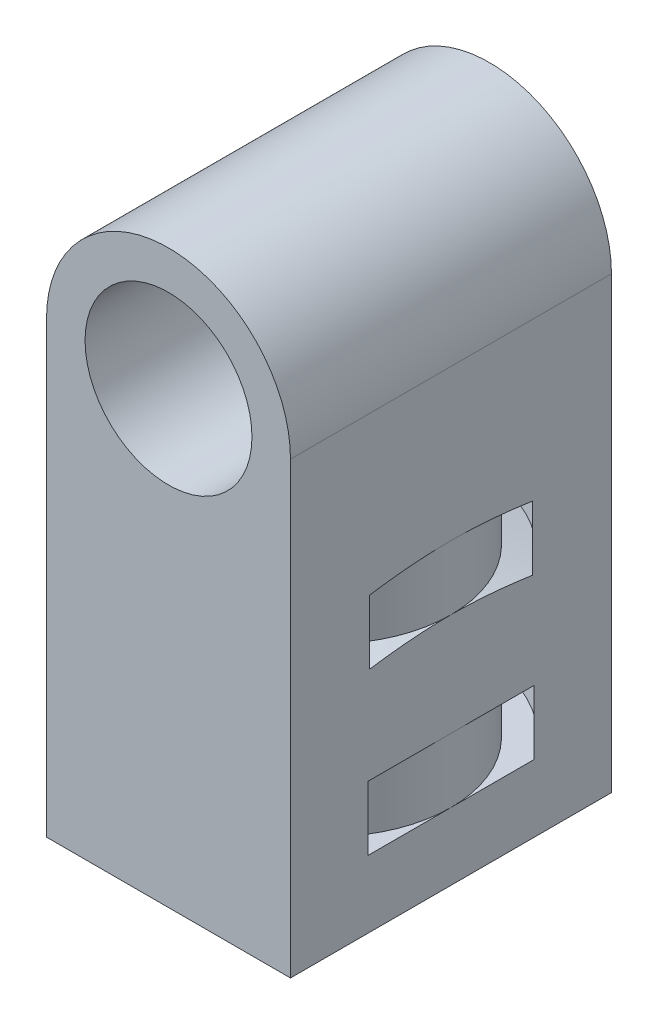
ISO-10303-21;
HEADER;
FILE_DESCRIPTION(('STEP AP214'),'2;1');
FILE_NAME('part.step','',(''),(''),'','','');
FILE_SCHEMA(('AUTOMOTIVE_DESIGN { 1 0 10303 214 1 1 1 1 }'));
ENDSEC;
DATA;
#1=APPLICATION_CONTEXT('core data for automotive mechanical design processes');
#2=APPLICATION_PROTOCOL_DEFINITION('international standard','automotive_design',2000,#1);
#3=PRODUCT_CONTEXT('',#1,'mechanical');
#4=PRODUCT('Part','Part','',(#3));
#5=PRODUCT_RELATED_PRODUCT_CATEGORY('part','',(#4));
#6=PRODUCT_DEFINITION_FORMATION('','',#4);
#7=PRODUCT_DEFINITION_CONTEXT('part definition',#1,'design');
#8=PRODUCT_DEFINITION('design','',#6,#7);
#9=PRODUCT_DEFINITION_SHAPE('','',#8);
#10=(LENGTH_UNIT() NAMED_UNIT(*) SI_UNIT(.MILLI.,.METRE.));
#11=(NAMED_UNIT(*) PLANE_ANGLE_UNIT() SI_UNIT($,.RADIAN.));
#12=(NAMED_UNIT(*) SI_UNIT($,.STERADIAN.) SOLID_ANGLE_UNIT());
#13=UNCERTAINTY_MEASURE_WITH_UNIT(LENGTH_MEASURE(1.E-05),#10,'distance_accuracy_value','');
#14=(GEOMETRIC_REPRESENTATION_CONTEXT(3) GLOBAL_UNCERTAINTY_ASSIGNED_CONTEXT((#13)) GLOBAL_UNIT_ASSIGNED_CONTEXT((#10,
#11,#12)) REPRESENTATION_CONTEXT('',''));
#15=CARTESIAN_POINT('',(0.,0.,0.));
#16=DIRECTION('',(0.,0.,1.));
#17=DIRECTION('',(1.,0.,0.));
#18=AXIS2_PLACEMENT_3D('',#15,#16,#17);
#19=CARTESIAN_POINT('',(9.5,-10.,-12.5));
#20=DIRECTION('',(1.,0.,0.));
#21=DIRECTION('',(0.,1.,0.));
#22=AXIS2_PLACEMENT_3D('',#19,#20,#21);
#23=PLANE('',#22);
#24=DIRECTION('',(0.,0.,-1.));
#25=VECTOR('',#24,1.);
#26=CARTESIAN_POINT('',(9.5,-29.75,-12.5));
#27=LINE('',#26,#25);
#28=CARTESIAN_POINT('',(9.5,-29.75,6.48074069840786));
#29=VERTEX_POINT('',#28);
#30=CARTESIAN_POINT('',(9.5,-29.75,0.));
#31=VERTEX_POINT('',#30);
#32=EDGE_CURVE('E312',#29,#31,#27,.T.);
#33=ORIENTED_EDGE('',*,*,#32,.F.);
#34=DIRECTION('',(0.,1.,0.));
#35=VECTOR('',#34,1.);
#36=CARTESIAN_POINT('',(9.5,-6.5,6.48074069840786));
#37=LINE('',#36,#35);
#38=CARTESIAN_POINT('',(9.5,-24.75,6.48074069840786));
#39=VERTEX_POINT('',#38);
#40=EDGE_CURVE('E336',#39,#29,#37,.F.);
#41=ORIENTED_EDGE('',*,*,#40,.F.);
#42=DIRECTION('',(0.,0.,-1.));
#43=VECTOR('',#42,1.);
#44=CARTESIAN_POINT('',(9.5,-24.75,-12.5));
#45=LINE('',#44,#43);
#46=CARTESIAN_POINT('',(9.5,-24.75,0.));
#47=VERTEX_POINT('',#46);
#48=EDGE_CURVE('E339',#39,#47,#45,.T.);
#49=ORIENTED_EDGE('',*,*,#48,.T.);
#50=CARTESIAN_POINT('',(9.5,-24.75,-6.48074069840786));
#51=VERTEX_POINT('',#50);
#52=EDGE_CURVE('E176',#47,#51,#45,.T.);
#53=ORIENTED_EDGE('',*,*,#52,.T.);
#54=DIRECTION('',(0.,1.,0.));
#55=VECTOR('',#54,1.);
#56=CARTESIAN_POINT('',(9.5,-6.5,-6.48074069840786));
#57=LINE('',#56,#55);
#58=CARTESIAN_POINT('',(9.5,-29.75,-6.48074069840786));
#59=VERTEX_POINT('',#58);
#60=EDGE_CURVE('E334',#59,#51,#57,.T.);
#61=ORIENTED_EDGE('',*,*,#60,.F.);
#62=EDGE_CURVE('E331',#31,#59,#27,.T.);
#63=ORIENTED_EDGE('',*,*,#62,.F.);
#64=EDGE_LOOP('',(#33,#41,#49,#53,#61,#63));
#65=FACE_BOUND('',#64,.T.);
#66=DIRECTION('',(0.,1.,0.));
#67=VECTOR('',#66,1.);
#68=CARTESIAN_POINT('',(9.5,-10.,12.5));
#69=LINE('',#68,#67);
#70=CARTESIAN_POINT('',(9.5,-35.,12.5));
#71=VERTEX_POINT('',#70);
#72=CARTESIAN_POINT('',(9.5,0.,12.5));
#73=VERTEX_POINT('',#72);
#74=EDGE_CURVE('E316',#71,#73,#69,.T.);
#75=ORIENTED_EDGE('',*,*,#74,.F.);
#76=DIRECTION('',(0.,0.,1.));
#77=VECTOR('',#76,1.);
#78=CARTESIAN_POINT('',(9.5,-35.,-12.5));
#79=LINE('',#78,#77);
#80=CARTESIAN_POINT('',(9.5,-35.,-12.5));
#81=VERTEX_POINT('',#80);
#82=EDGE_CURVE('E423',#81,#71,#79,.T.);
#83=ORIENTED_EDGE('',*,*,#82,.F.);
#84=DIRECTION('',(0.,1.,0.));
#85=VECTOR('',#84,1.);
#86=CARTESIAN_POINT('',(9.5,-10.,-12.5));
#87=LINE('',#86,#85);
#88=CARTESIAN_POINT('',(9.5,0.,-12.5));
#89=VERTEX_POINT('',#88);
#90=EDGE_CURVE('E439',#81,#89,#87,.T.);
#91=ORIENTED_EDGE('',*,*,#90,.T.);
#92=DIRECTION('',(0.,0.,1.));
#93=VECTOR('',#92,1.);
#94=CARTESIAN_POINT('',(9.5,0.,-12.5));
#95=LINE('',#94,#93);
#96=EDGE_CURVE('E451',#89,#73,#95,.T.);
#97=ORIENTED_EDGE('',*,*,#96,.T.);
#98=EDGE_LOOP('',(#75,#83,#91,#97));
#99=FACE_BOUND('',#98,.T.);
#100=CARTESIAN_POINT('',(9.5,-18.5940001794606,34.3096150478611));
#101=CARTESIAN_POINT('',(9.5,-18.4104595878438,33.583287858128));
#102=CARTESIAN_POINT('',(9.5,-18.2272942427413,32.8568655741935));
#103=CARTESIAN_POINT('',(9.5,-17.8619040372227,31.4037835481128));
#104=CARTESIAN_POINT('',(9.5,-17.6796791780349,30.6771238056579));
#105=CARTESIAN_POINT('',(9.5,-17.316309413949,29.2233174338884));
#106=CARTESIAN_POINT('',(9.5,-17.1351648266208,28.4961707251553));
#107=CARTESIAN_POINT('',(9.5,-16.7742688751346,27.0415315671237));
#108=CARTESIAN_POINT('',(9.5,-16.5945175107908,26.3140391178712));
#109=CARTESIAN_POINT('',(9.5,-16.2325036702304,24.8413595475527));
#110=CARTESIAN_POINT('',(9.5,-16.0502828229413,24.0961621847589));
#111=CARTESIAN_POINT('',(9.5,-15.6881513560162,22.6052065111694));
#112=CARTESIAN_POINT('',(9.5,-15.5082407340685,21.8594482009359));
#113=CARTESIAN_POINT('',(9.5,-15.1514551431804,20.3674081549243));
#114=CARTESIAN_POINT('',(9.5,-14.9745794026589,19.6211266039413));
#115=CARTESIAN_POINT('',(9.5,-14.6247702626984,18.1276365749566));
#116=CARTESIAN_POINT('',(9.5,-14.4518368707429,17.3804280951981));
#117=CARTESIAN_POINT('',(9.5,-14.1187198970002,15.9174306703127));
#118=CARTESIAN_POINT('',(9.5,-13.9583092568577,15.2016936038036));
#119=CARTESIAN_POINT('',(9.5,-13.6441128718866,13.7687633704708));
#120=CARTESIAN_POINT('',(9.5,-13.4903271161288,13.0515702060512));
#121=CARTESIAN_POINT('',(9.5,-13.1917895153087,11.6145241203518));
#122=CARTESIAN_POINT('',(9.5,-13.0470470186099,10.8946692356507));
#123=CARTESIAN_POINT('',(9.5,-12.839755242133,9.81298195188404));
#124=CARTESIAN_POINT('',(9.5,-12.7722931956616,9.45209172028482));
#125=CARTESIAN_POINT('',(9.5,-12.6413092515822,8.72959877826552));
#126=CARTESIAN_POINT('',(9.5,-12.5777873110619,8.36799607564936));
#127=CARTESIAN_POINT('',(9.5,-12.4562624738004,7.64881234547324));
#128=CARTESIAN_POINT('',(9.5,-12.3981973188229,7.29124192731229));
#129=CARTESIAN_POINT('',(9.5,-12.2875208224032,6.57526148055471));
#130=CARTESIAN_POINT('',(9.5,-12.2349095407431,6.2168514427987));
#131=CARTESIAN_POINT('',(9.5,-12.0867396466977,5.14026211042967));
#132=CARTESIAN_POINT('',(9.5,-12.0008366490465,4.42067580269187));
#133=CARTESIAN_POINT('',(9.5,-11.8979840507362,3.33969834915197));
#134=CARTESIAN_POINT('',(9.5,-11.8680533098223,2.97952705245293));
#135=CARTESIAN_POINT('',(9.5,-11.8178069673897,2.25850381276945));
#136=CARTESIAN_POINT('',(9.5,-11.7974912985723,1.89765187456677));
#137=CARTESIAN_POINT('',(9.5,-11.7672603900713,1.17556904098546));
#138=CARTESIAN_POINT('',(9.5,-11.7573434008062,0.814338219595086));
#139=CARTESIAN_POINT('',(9.5,-11.7483184953059,0.0917406115624856));
#140=CARTESIAN_POINT('',(9.5,-11.7492105291058,-0.269626174443523));
#141=CARTESIAN_POINT('',(9.5,-11.7615452144799,-0.979590021655254));
#142=CARTESIAN_POINT('',(9.5,-11.7726194406145,-1.32819362528374));
#143=CARTESIAN_POINT('',(9.5,-11.8043716631822,-2.02495921088784));
#144=CARTESIAN_POINT('',(9.5,-11.8250496920841,-2.3731211913664));
#145=CARTESIAN_POINT('',(9.5,-11.8752800186238,-3.06885676445908));
#146=CARTESIAN_POINT('',(9.5,-11.9048338111138,-3.41643024803479));
#147=CARTESIAN_POINT('',(9.5,-11.9718973690187,-4.11081466006508));
#148=CARTESIAN_POINT('',(9.5,-12.0094074842543,-4.45762555431275));
#149=CARTESIAN_POINT('',(9.5,-12.1325595533156,-5.49846097059398));
#150=CARTESIAN_POINT('',(9.5,-12.2286955308348,-6.19124608496361));
#151=CARTESIAN_POINT('',(9.5,-12.4413393013675,-7.57355613875835));
#152=CARTESIAN_POINT('',(9.5,-12.557846278919,-8.26308120755049));
#153=CARTESIAN_POINT('',(9.5,-12.8070220094514,-9.64873950406036));
#154=CARTESIAN_POINT('',(9.5,-12.9398867973797,-10.344837116822));
#155=CARTESIAN_POINT('',(9.5,-13.2161792537895,-11.7349056381745));
#156=CARTESIAN_POINT('',(9.5,-13.3596068317596,-12.4288765649356));
#157=CARTESIAN_POINT('',(9.5,-13.6538996084103,-13.814436250205));
#158=CARTESIAN_POINT('',(9.5,-13.8047564832014,-14.5060267859574));
#159=CARTESIAN_POINT('',(9.5,-14.1120291641412,-15.8879648182586));
#160=CARTESIAN_POINT('',(9.5,-14.2684449535411,-16.5783123185461));
#161=CARTESIAN_POINT('',(9.5,-14.5923627636727,-17.9882129158208));
#162=CARTESIAN_POINT('',(9.5,-14.760050488671,-18.7077232451551));
#163=CARTESIAN_POINT('',(9.5,-15.0988377625137,-20.1459384828576));
#164=CARTESIAN_POINT('',(9.5,-15.2699373109351,-20.8646433913256));
#165=CARTESIAN_POINT('',(9.5,-15.6148158829257,-22.3016540726439));
#166=CARTESIAN_POINT('',(9.5,-15.7885957519021,-23.0199596423348));
#167=CARTESIAN_POINT('',(9.5,-16.1382105351397,-24.4560706148763));
#168=CARTESIAN_POINT('',(9.5,-16.3140454510682,-25.1738760173206));
#169=CARTESIAN_POINT('',(9.5,-16.6635670998738,-26.5937178124066));
#170=CARTESIAN_POINT('',(9.5,-16.8372192064394,-27.295762735252));
#171=CARTESIAN_POINT('',(9.5,-17.1857929643631,-28.6995373694732));
#172=CARTESIAN_POINT('',(9.5,-17.3607146160361,-29.4012670807707));
#173=CARTESIAN_POINT('',(9.5,-17.7115372088056,-30.8042243982583));
#174=CARTESIAN_POINT('',(9.5,-17.8874377913662,-31.5054520941489));
#175=CARTESIAN_POINT('',(9.5,-18.2401088008124,-32.9076878120199));
#176=CARTESIAN_POINT('',(9.5,-18.4168792266013,-33.608695834276));
#177=CARTESIAN_POINT('',(9.5,-18.5940001794606,-34.3096150478611));
#178=B_SPLINE_CURVE_WITH_KNOTS('',3,(#100,#101,#102,#103,#104,#105,#106,#107,#108,#109,#110,
#111,#112,#113,#114,#115,#116,#117,#118,#119,#120,#121,#122,#123,#124,#125,#126,#127,#128,#129,
#130,#131,#132,#133,#134,#135,#136,#137,#138,#139,#140,#141,#142,#143,#144,#145,#146,#147,#148,
#149,#150,#151,#152,#153,#154,#155,#156,#157,#158,#159,#160,#161,#162,#163,#164,#165,#166,#167,
#168,#169,#170,#171,#172,#173,#174,#175,#176,#177),.UNSPECIFIED.,.F.,.F.,(4,2,2,2,2,2,2,2,2,2,2,
2,2,2,2,2,2,2,2,2,2,2,2,2,2,2,2,2,2,2,2,2,2,2,2,2,2,2,4),(0.,2.24747554583677,4.4949540263018,
6.74306350480392,8.99117268337091,11.2926284845608,13.5940819827856,15.894941425808,
18.1958052360467,20.3962589262327,22.5967089861222,24.7993973315644,25.9008042763521,
27.0021992234385,28.0889193333589,29.1756513540005,31.3489699082154,32.4331041183486,
33.5172307401912,34.6011749280527,35.6851141053588,36.7313134417835,37.7775163152511,
38.8238954886518,39.8703206784272,41.9681082944804,44.065811954192,46.1916871419316,
48.3175441154162,50.4410711579981,52.564591803064,54.7809581966685,56.9973243155716,
59.2144044120004,61.4314863073811,63.6010929495919,65.7707001301629,67.9395590701614,
70.1084152760672),.UNSPECIFIED.);
#179=CARTESIAN_POINT('',(9.5,-12.2572833711301,6.36396078731212));
#180=VERTEX_POINT('',#179);
#181=CARTESIAN_POINT('',(9.5,-11.75,0.));
#182=VERTEX_POINT('',#181);
#183=EDGE_CURVE('E241',#180,#182,#178,.T.);
#184=ORIENTED_EDGE('',*,*,#183,.T.);
#185=CARTESIAN_POINT('',(9.5,-12.2572833711301,-6.36396078731212));
#186=VERTEX_POINT('',#185);
#187=EDGE_CURVE('E232',#182,#186,#178,.T.);
#188=ORIENTED_EDGE('',*,*,#187,.T.);
#189=DIRECTION('',(0.,1.,0.));
#190=VECTOR('',#189,1.);
#191=CARTESIAN_POINT('',(9.5,-6.5,-6.36396078731212));
#192=LINE('',#191,#190);
#193=CARTESIAN_POINT('',(9.5,-17.2572833711301,-6.36396078731212));
#194=VERTEX_POINT('',#193);
#195=EDGE_CURVE('E242',#186,#194,#192,.F.);
#196=ORIENTED_EDGE('',*,*,#195,.T.);
#197=CARTESIAN_POINT('',(9.5,-23.5940001794606,34.3096150478611));
#198=CARTESIAN_POINT('',(9.5,-23.4104595878438,33.583287858128));
#199=CARTESIAN_POINT('',(9.5,-23.2272942427413,32.8568655741935));
#200=CARTESIAN_POINT('',(9.5,-22.8619040372227,31.4037835481128));
#201=CARTESIAN_POINT('',(9.5,-22.6796791780349,30.6771238056579));
#202=CARTESIAN_POINT('',(9.5,-22.316309413949,29.2233174338884));
#203=CARTESIAN_POINT('',(9.5,-22.1351648266208,28.4961707251553));
#204=CARTESIAN_POINT('',(9.5,-21.7742688751346,27.0415315671237));
#205=CARTESIAN_POINT('',(9.5,-21.5945175107908,26.3140391178712));
#206=CARTESIAN_POINT('',(9.5,-21.2325036702303,24.8413595475526));
#207=CARTESIAN_POINT('',(9.5,-21.0502828229413,24.0961621847589));
#208=CARTESIAN_POINT('',(9.5,-20.6881513560162,22.6052065111694));
#209=CARTESIAN_POINT('',(9.5,-20.5082407340685,21.8594482009358));
#210=CARTESIAN_POINT('',(9.5,-20.1514551431804,20.3674081549243));
#211=CARTESIAN_POINT('',(9.5,-19.9745794026589,19.6211266039413));
#212=CARTESIAN_POINT('',(9.5,-19.6247702626984,18.1276365749566));
#213=CARTESIAN_POINT('',(9.5,-19.4518368707429,17.3804280951981));
#214=CARTESIAN_POINT('',(9.5,-19.1187198970002,15.9174306703127));
#215=CARTESIAN_POINT('',(9.5,-18.9583092568577,15.2016936038036));
#216=CARTESIAN_POINT('',(9.5,-18.6441128718866,13.7687633704708));
#217=CARTESIAN_POINT('',(9.5,-18.4903271161288,13.0515702060512));
#218=CARTESIAN_POINT('',(9.5,-18.1917895153087,11.6145241203518));
#219=CARTESIAN_POINT('',(9.5,-18.04704701861,10.8946692356508));
#220=CARTESIAN_POINT('',(9.5,-17.839755242133,9.81298195188405));
#221=CARTESIAN_POINT('',(9.5,-17.7722931956616,9.45209172028482));
#222=CARTESIAN_POINT('',(9.5,-17.6413092515822,8.72959877826553));
#223=CARTESIAN_POINT('',(9.5,-17.5777873110619,8.36799607564936));
#224=CARTESIAN_POINT('',(9.5,-17.4562624738004,7.64881234547325));
#225=CARTESIAN_POINT('',(9.5,-17.3981973188229,7.29124192731229));
#226=CARTESIAN_POINT('',(9.5,-17.2875208224032,6.57526148055472));
#227=CARTESIAN_POINT('',(9.5,-17.2349095407431,6.21685144279871));
#228=CARTESIAN_POINT('',(9.5,-17.0867396466977,5.14026211042967));
#229=CARTESIAN_POINT('',(9.5,-17.0008366490465,4.42067580269187));
#230=CARTESIAN_POINT('',(9.5,-16.8979840507362,3.33969834915197));
#231=CARTESIAN_POINT('',(9.5,-16.8680533098223,2.97952705245293));
#232=CARTESIAN_POINT('',(9.5,-16.8178069673897,2.25850381276945));
#233=CARTESIAN_POINT('',(9.5,-16.7974912985723,1.89765187456678));
#234=CARTESIAN_POINT('',(9.5,-16.7672603900713,1.17556904098547));
#235=CARTESIAN_POINT('',(9.5,-16.7573434008062,0.814338219595099));
#236=CARTESIAN_POINT('',(9.5,-16.7483184953059,0.0917406115624991));
#237=CARTESIAN_POINT('',(9.5,-16.7492105291058,-0.269626174443511));
#238=CARTESIAN_POINT('',(9.5,-16.7615452144799,-0.979590021655243));
#239=CARTESIAN_POINT('',(9.5,-16.7726194406145,-1.32819362528373));
#240=CARTESIAN_POINT('',(9.5,-16.8043716631822,-2.02495921088782));
#241=CARTESIAN_POINT('',(9.5,-16.8250496920841,-2.37312119136639));
#242=CARTESIAN_POINT('',(9.5,-16.8752800186238,-3.06885676445907));
#243=CARTESIAN_POINT('',(9.5,-16.9048338111138,-3.41643024803478));
#244=CARTESIAN_POINT('',(9.5,-16.9718973690187,-4.11081466006507));
#245=CARTESIAN_POINT('',(9.5,-17.0094074842543,-4.45762555431274));
#246=CARTESIAN_POINT('',(9.5,-17.1325595533156,-5.49846097059397));
#247=CARTESIAN_POINT('',(9.5,-17.2286955308348,-6.1912460849636));
#248=CARTESIAN_POINT('',(9.5,-17.4413393013675,-7.57355613875833));
#249=CARTESIAN_POINT('',(9.5,-17.557846278919,-8.26308120755048));
#250=CARTESIAN_POINT('',(9.5,-17.8070220094514,-9.64873950406035));
#251=CARTESIAN_POINT('',(9.5,-17.9398867973797,-10.344837116822));
#252=CARTESIAN_POINT('',(9.5,-18.2161792537895,-11.7349056381745));
#253=CARTESIAN_POINT('',(9.5,-18.3596068317596,-12.4288765649356));
#254=CARTESIAN_POINT('',(9.5,-18.6538996084103,-13.814436250205));
#255=CARTESIAN_POINT('',(9.5,-18.8047564832014,-14.5060267859573));
#256=CARTESIAN_POINT('',(9.5,-19.1120291641412,-15.8879648182586));
#257=CARTESIAN_POINT('',(9.5,-19.2684449535411,-16.5783123185461));
#258=CARTESIAN_POINT('',(9.5,-19.5923627636726,-17.9882129158208));
#259=CARTESIAN_POINT('',(9.5,-19.760050488671,-18.7077232451551));
#260=CARTESIAN_POINT('',(9.5,-20.0988377625137,-20.1459384828576));
#261=CARTESIAN_POINT('',(9.5,-20.2699373109351,-20.8646433913256));
#262=CARTESIAN_POINT('',(9.5,-20.6148158829257,-22.3016540726439));
#263=CARTESIAN_POINT('',(9.5,-20.7885957519021,-23.0199596423348));
#264=CARTESIAN_POINT('',(9.5,-21.1382105351397,-24.4560706148762));
#265=CARTESIAN_POINT('',(9.5,-21.3140454510682,-25.1738760173206));
#266=CARTESIAN_POINT('',(9.5,-21.6635670998738,-26.5937178124066));
#267=CARTESIAN_POINT('',(9.5,-21.8372192064394,-27.295762735252));
#268=CARTESIAN_POINT('',(9.5,-22.1857929643631,-28.6995373694732));
#269=CARTESIAN_POINT('',(9.5,-22.3607146160361,-29.4012670807707));
#270=CARTESIAN_POINT('',(9.5,-22.7115372088056,-30.8042243982583));
#271=CARTESIAN_POINT('',(9.5,-22.8874377913662,-31.5054520941489));
#272=CARTESIAN_POINT('',(9.5,-23.2401088008124,-32.9076878120198));
#273=CARTESIAN_POINT('',(9.5,-23.4168792266013,-33.608695834276));
#274=CARTESIAN_POINT('',(9.5,-23.5940001794606,-34.3096150478611));
#275=B_SPLINE_CURVE_WITH_KNOTS('',3,(#197,#198,#199,#200,#201,#202,#203,#204,#205,#206,#207,
#208,#209,#210,#211,#212,#213,#214,#215,#216,#217,#218,#219,#220,#221,#222,#223,#224,#225,#226,
#227,#228,#229,#230,#231,#232,#233,#234,#235,#236,#237,#238,#239,#240,#241,#242,#243,#244,#245,
#246,#247,#248,#249,#250,#251,#252,#253,#254,#255,#256,#257,#258,#259,#260,#261,#262,#263,#264,
#265,#266,#267,#268,#269,#270,#271,#272,#273,#274),.UNSPECIFIED.,.F.,.F.,(4,2,2,2,2,2,2,2,2,2,2,
2,2,2,2,2,2,2,2,2,2,2,2,2,2,2,2,2,2,2,2,2,2,2,2,2,2,2,4),(0.,2.24747554583678,4.4949540263018,
6.74306350480391,8.99117268337091,11.2926284845608,13.5940819827856,15.894941425808,
18.1958052360467,20.3962589262327,22.5967089861222,24.7993973315644,25.900804276352,
27.0021992234385,28.0889193333589,29.1756513540005,31.3489699082154,32.4331041183485,
33.5172307401911,34.6011749280527,35.6851141053587,36.7313134417835,37.7775163152511,
38.8238954886518,39.8703206784272,41.9681082944804,44.065811954192,46.1916871419316,
48.3175441154162,50.4410711579981,52.564591803064,54.7809581966685,56.9973243155716,
59.2144044120004,61.4314863073811,63.6010929495919,65.7707001301629,67.9395590701614,
70.1084152760672),.UNSPECIFIED.);
#276=CARTESIAN_POINT('',(9.5,-16.75,0.));
#277=VERTEX_POINT('',#276);
#278=EDGE_CURVE('E244',#277,#194,#275,.T.);
#279=ORIENTED_EDGE('',*,*,#278,.F.);
#280=CARTESIAN_POINT('',(9.5,-17.2572833711301,6.36396078731212));
#281=VERTEX_POINT('',#280);
#282=EDGE_CURVE('E251',#281,#277,#275,.T.);
#283=ORIENTED_EDGE('',*,*,#282,.F.);
#284=DIRECTION('',(0.,1.,0.));
#285=VECTOR('',#284,1.);
#286=CARTESIAN_POINT('',(9.5,-6.5,6.36396078731212));
#287=LINE('',#286,#285);
#288=EDGE_CURVE('E322',#281,#180,#287,.T.);
#289=ORIENTED_EDGE('',*,*,#288,.T.);
#290=EDGE_LOOP('',(#184,#188,#196,#279,#283,#289));
#291=FACE_BOUND('',#290,.T.);
#292=ADVANCED_FACE('F40',(#65,#99,#291),#23,.T.);
#293=CARTESIAN_POINT('',(-9.5,-10.,-12.5));
#294=DIRECTION('',(-1.,0.,0.));
#295=DIRECTION('',(0.,-1.,0.));
#296=AXIS2_PLACEMENT_3D('',#293,#294,#295);
#297=PLANE('',#296);
#298=DIRECTION('',(0.,0.,1.));
#299=VECTOR('',#298,1.);
#300=CARTESIAN_POINT('',(-9.5,-29.75,-12.5));
#301=LINE('',#300,#299);
#302=CARTESIAN_POINT('',(-9.5,-29.75,-6.48074069840785));
#303=VERTEX_POINT('',#302);
#304=CARTESIAN_POINT('',(-9.5,-29.75,0.));
#305=VERTEX_POINT('',#304);
#306=EDGE_CURVE('E200',#303,#305,#301,.T.);
#307=ORIENTED_EDGE('',*,*,#306,.F.);
#308=DIRECTION('',(0.,1.,0.));
#309=VECTOR('',#308,1.);
#310=CARTESIAN_POINT('',(-9.5,-6.5,-6.48074069840785));
#311=LINE('',#310,#309);
#312=CARTESIAN_POINT('',(-9.5,-24.75,-6.48074069840785));
#313=VERTEX_POINT('',#312);
#314=EDGE_CURVE('E187',#313,#303,#311,.F.);
#315=ORIENTED_EDGE('',*,*,#314,.F.);
#316=DIRECTION('',(0.,0.,1.));
#317=VECTOR('',#316,1.);
#318=CARTESIAN_POINT('',(-9.5,-24.75,-12.5));
#319=LINE('',#318,#317);
#320=CARTESIAN_POINT('',(-9.5,-24.75,0.));
#321=VERTEX_POINT('',#320);
#322=EDGE_CURVE('E169',#313,#321,#319,.T.);
#323=ORIENTED_EDGE('',*,*,#322,.T.);
#324=CARTESIAN_POINT('',(-9.5,-24.75,6.48074069840785));
#325=VERTEX_POINT('',#324);
#326=EDGE_CURVE('E156',#321,#325,#319,.T.);
#327=ORIENTED_EDGE('',*,*,#326,.T.);
#328=DIRECTION('',(0.,1.,0.));
#329=VECTOR('',#328,1.);
#330=CARTESIAN_POINT('',(-9.5,-6.5,6.48074069840785));
#331=LINE('',#330,#329);
#332=CARTESIAN_POINT('',(-9.5,-29.75,6.48074069840785));
#333=VERTEX_POINT('',#332);
#334=EDGE_CURVE('E190',#333,#325,#331,.T.);
#335=ORIENTED_EDGE('',*,*,#334,.F.);
#336=EDGE_CURVE('E197',#305,#333,#301,.T.);
#337=ORIENTED_EDGE('',*,*,#336,.F.);
#338=EDGE_LOOP('',(#307,#315,#323,#327,#335,#337));
#339=FACE_BOUND('',#338,.T.);
#340=DIRECTION('',(0.,-1.,0.));
#341=VECTOR('',#340,1.);
#342=CARTESIAN_POINT('',(-9.5,-10.,12.5));
#343=LINE('',#342,#341);
#344=CARTESIAN_POINT('',(-9.5,0.,12.5));
#345=VERTEX_POINT('',#344);
#346=CARTESIAN_POINT('',(-9.5,-35.,12.5));
#347=VERTEX_POINT('',#346);
#348=EDGE_CURVE('E444',#345,#347,#343,.T.);
#349=ORIENTED_EDGE('',*,*,#348,.F.);
#350=DIRECTION('',(0.,0.,1.));
#351=VECTOR('',#350,1.);
#352=CARTESIAN_POINT('',(-9.5,0.,-12.5));
#353=LINE('',#352,#351);
#354=CARTESIAN_POINT('',(-9.5,0.,-12.5));
#355=VERTEX_POINT('',#354);
#356=EDGE_CURVE('E460',#355,#345,#353,.T.);
#357=ORIENTED_EDGE('',*,*,#356,.F.);
#358=DIRECTION('',(0.,-1.,0.));
#359=VECTOR('',#358,1.);
#360=CARTESIAN_POINT('',(-9.5,-10.,-12.5));
#361=LINE('',#360,#359);
#362=CARTESIAN_POINT('',(-9.5,-35.,-12.5));
#363=VERTEX_POINT('',#362);
#364=EDGE_CURVE('E448',#355,#363,#361,.T.);
#365=ORIENTED_EDGE('',*,*,#364,.T.);
#366=DIRECTION('',(0.,0.,-1.));
#367=VECTOR('',#366,1.);
#368=CARTESIAN_POINT('',(-9.5,-35.,-12.5));
#369=LINE('',#368,#367);
#370=EDGE_CURVE('E414',#347,#363,#369,.T.);
#371=ORIENTED_EDGE('',*,*,#370,.F.);
#372=EDGE_LOOP('',(#349,#357,#365,#371));
#373=FACE_BOUND('',#372,.T.);
#374=CARTESIAN_POINT('',(-9.5,-18.5940001794606,-34.3096150478611));
#375=CARTESIAN_POINT('',(-9.5,-18.4104595878438,-33.583287858128));
#376=CARTESIAN_POINT('',(-9.5,-18.2272942427413,-32.8568655741935));
#377=CARTESIAN_POINT('',(-9.5,-17.8619040372227,-31.4037835481128));
#378=CARTESIAN_POINT('',(-9.5,-17.6796791780349,-30.6771238056579));
#379=CARTESIAN_POINT('',(-9.5,-17.316309413949,-29.2233174338884));
#380=CARTESIAN_POINT('',(-9.5,-17.1351648266208,-28.4961707251553));
#381=CARTESIAN_POINT('',(-9.5,-16.7742688751346,-27.0415315671237));
#382=CARTESIAN_POINT('',(-9.5,-16.5945175107908,-26.3140391178712));
#383=CARTESIAN_POINT('',(-9.5,-16.2325036702303,-24.8413595475526));
#384=CARTESIAN_POINT('',(-9.5,-16.0502828229413,-24.0961621847589));
#385=CARTESIAN_POINT('',(-9.5,-15.6881513560162,-22.6052065111694));
#386=CARTESIAN_POINT('',(-9.5,-15.5082407340685,-21.8594482009359));
#387=CARTESIAN_POINT('',(-9.5,-15.1514551431804,-20.3674081549243));
#388=CARTESIAN_POINT('',(-9.5,-14.9745794026589,-19.6211266039413));
#389=CARTESIAN_POINT('',(-9.5,-14.6247702626984,-18.1276365749566));
#390=CARTESIAN_POINT('',(-9.5,-14.4518368707429,-17.3804280951981));
#391=CARTESIAN_POINT('',(-9.5,-14.1187198970002,-15.9174306703127));
#392=CARTESIAN_POINT('',(-9.5,-13.9583092568577,-15.2016936038036));
#393=CARTESIAN_POINT('',(-9.5,-13.6441128718866,-13.7687633704708));
#394=CARTESIAN_POINT('',(-9.5,-13.4903271161288,-13.0515702060512));
#395=CARTESIAN_POINT('',(-9.5,-13.1917895153087,-11.6145241203518));
#396=CARTESIAN_POINT('',(-9.5,-13.04704701861,-10.8946692356507));
#397=CARTESIAN_POINT('',(-9.5,-12.839755242133,-9.81298195188404));
#398=CARTESIAN_POINT('',(-9.5,-12.7722931956616,-9.45209172028482));
#399=CARTESIAN_POINT('',(-9.5,-12.6413092515822,-8.72959877826552));
#400=CARTESIAN_POINT('',(-9.5,-12.5777873110619,-8.36799607564936));
#401=CARTESIAN_POINT('',(-9.5,-12.4562624738004,-7.64881234547324));
#402=CARTESIAN_POINT('',(-9.5,-12.3981973188229,-7.29124192731229));
#403=CARTESIAN_POINT('',(-9.5,-12.2875208224032,-6.57526148055471));
#404=CARTESIAN_POINT('',(-9.5,-12.2349095407431,-6.2168514427987));
#405=CARTESIAN_POINT('',(-9.5,-12.0867396466977,-5.14026211042967));
#406=CARTESIAN_POINT('',(-9.5,-12.0008366490465,-4.42067580269187));
#407=CARTESIAN_POINT('',(-9.5,-11.8979840507362,-3.33969834915197));
#408=CARTESIAN_POINT('',(-9.5,-11.8680533098223,-2.97952705245293));
#409=CARTESIAN_POINT('',(-9.5,-11.8178069673897,-2.25850381276945));
#410=CARTESIAN_POINT('',(-9.5,-11.7974912985723,-1.89765187456677));
#411=CARTESIAN_POINT('',(-9.5,-11.7672603900713,-1.17556904098546));
#412=CARTESIAN_POINT('',(-9.5,-11.7573434008062,-0.814338219595086));
#413=CARTESIAN_POINT('',(-9.5,-11.7483184953059,-0.0917406115624862));
#414=CARTESIAN_POINT('',(-9.5,-11.7492105291058,0.269626174443522));
#415=CARTESIAN_POINT('',(-9.5,-11.7615452144799,0.979590021655253));
#416=CARTESIAN_POINT('',(-9.5,-11.7726194406145,1.32819362528374));
#417=CARTESIAN_POINT('',(-9.5,-11.8043716631822,2.02495921088783));
#418=CARTESIAN_POINT('',(-9.5,-11.8250496920841,2.3731211913664));
#419=CARTESIAN_POINT('',(-9.5,-11.8752800186238,3.06885676445908));
#420=CARTESIAN_POINT('',(-9.5,-11.9048338111138,3.41643024803479));
#421=CARTESIAN_POINT('',(-9.5,-11.9718973690187,4.11081466006508));
#422=CARTESIAN_POINT('',(-9.5,-12.0094074842543,4.45762555431275));
#423=CARTESIAN_POINT('',(-9.5,-12.1325595533157,5.49846097059398));
#424=CARTESIAN_POINT('',(-9.5,-12.2286955308348,6.19124608496361));
#425=CARTESIAN_POINT('',(-9.5,-12.4413393013675,7.57355613875835));
#426=CARTESIAN_POINT('',(-9.5,-12.557846278919,8.26308120755049));
#427=CARTESIAN_POINT('',(-9.5,-12.8070220094514,9.64873950406036));
#428=CARTESIAN_POINT('',(-9.5,-12.9398867973797,10.344837116822));
#429=CARTESIAN_POINT('',(-9.5,-13.2161792537895,11.7349056381745));
#430=CARTESIAN_POINT('',(-9.5,-13.3596068317596,12.4288765649356));
#431=CARTESIAN_POINT('',(-9.5,-13.6538996084103,13.814436250205));
#432=CARTESIAN_POINT('',(-9.5,-13.8047564832014,14.5060267859574));
#433=CARTESIAN_POINT('',(-9.5,-14.1120291641412,15.8879648182586));
#434=CARTESIAN_POINT('',(-9.5,-14.2684449535411,16.5783123185461));
#435=CARTESIAN_POINT('',(-9.5,-14.5923627636727,17.9882129158208));
#436=CARTESIAN_POINT('',(-9.5,-14.760050488671,18.7077232451551));
#437=CARTESIAN_POINT('',(-9.5,-15.0988377625137,20.1459384828576));
#438=CARTESIAN_POINT('',(-9.5,-15.2699373109351,20.8646433913256));
#439=CARTESIAN_POINT('',(-9.5,-15.6148158829257,22.3016540726439));
#440=CARTESIAN_POINT('',(-9.5,-15.7885957519021,23.0199596423348));
#441=CARTESIAN_POINT('',(-9.5,-16.1382105351397,24.4560706148763));
#442=CARTESIAN_POINT('',(-9.5,-16.3140454510682,25.1738760173206));
#443=CARTESIAN_POINT('',(-9.5,-16.6635670998738,26.5937178124066));
#444=CARTESIAN_POINT('',(-9.5,-16.8372192064394,27.295762735252));
#445=CARTESIAN_POINT('',(-9.5,-17.1857929643631,28.6995373694732));
#446=CARTESIAN_POINT('',(-9.5,-17.3607146160361,29.4012670807707));
#447=CARTESIAN_POINT('',(-9.5,-17.7115372088056,30.8042243982583));
#448=CARTESIAN_POINT('',(-9.5,-17.8874377913662,31.5054520941489));
#449=CARTESIAN_POINT('',(-9.5,-18.2401088008124,32.9076878120199));
#450=CARTESIAN_POINT('',(-9.5,-18.4168792266013,33.608695834276));
#451=CARTESIAN_POINT('',(-9.5,-18.5940001794606,34.3096150478611));
#452=B_SPLINE_CURVE_WITH_KNOTS('',3,(#374,#375,#376,#377,#378,#379,#380,#381,#382,#383,#384,
#385,#386,#387,#388,#389,#390,#391,#392,#393,#394,#395,#396,#397,#398,#399,#400,#401,#402,#403,
#404,#405,#406,#407,#408,#409,#410,#411,#412,#413,#414,#415,#416,#417,#418,#419,#420,#421,#422,
#423,#424,#425,#426,#427,#428,#429,#430,#431,#432,#433,#434,#435,#436,#437,#438,#439,#440,#441,
#442,#443,#444,#445,#446,#447,#448,#449,#450,#451),.UNSPECIFIED.,.F.,.F.,(4,2,2,2,2,2,2,2,2,2,2,
2,2,2,2,2,2,2,2,2,2,2,2,2,2,2,2,2,2,2,2,2,2,2,2,2,2,2,4),(0.,2.24747554583677,4.49495402630181,
6.74306350480393,8.99117268337092,11.2926284845608,13.5940819827856,15.894941425808,
18.1958052360467,20.3962589262327,22.5967089861222,24.7993973315644,25.9008042763521,
27.0021992234385,28.0889193333589,29.1756513540005,31.3489699082154,32.4331041183486,
33.5172307401912,34.6011749280527,35.6851141053588,36.7313134417835,37.7775163152511,
38.8238954886518,39.8703206784272,41.9681082944804,44.065811954192,46.1916871419316,
48.3175441154162,50.4410711579981,52.564591803064,54.7809581966685,56.9973243155716,
59.2144044120004,61.4314863073811,63.6010929495919,65.7707001301629,67.9395590701614,
70.1084152760672),.UNSPECIFIED.);
#453=CARTESIAN_POINT('',(-9.5,-12.2572833711301,-6.36396078731211));
#454=VERTEX_POINT('',#453);
#455=CARTESIAN_POINT('',(-9.5,-11.75,0.));
#456=VERTEX_POINT('',#455);
#457=EDGE_CURVE('E51',#454,#456,#452,.T.);
#458=ORIENTED_EDGE('',*,*,#457,.T.);
#459=CARTESIAN_POINT('',(-9.5,-12.2572833711301,6.36396078731211));
#460=VERTEX_POINT('',#459);
#461=EDGE_CURVE('E11',#456,#460,#452,.T.);
#462=ORIENTED_EDGE('',*,*,#461,.T.);
#463=DIRECTION('',(0.,1.,0.));
#464=VECTOR('',#463,1.);
#465=CARTESIAN_POINT('',(-9.5,-6.5,6.36396078731211));
#466=LINE('',#465,#464);
#467=CARTESIAN_POINT('',(-9.5,-17.2572833711301,6.36396078731211));
#468=VERTEX_POINT('',#467);
#469=EDGE_CURVE('E44',#460,#468,#466,.F.);
#470=ORIENTED_EDGE('',*,*,#469,.T.);
#471=CARTESIAN_POINT('',(-9.5,-23.5940001794606,-34.3096150478611));
#472=CARTESIAN_POINT('',(-9.5,-23.4104595878438,-33.583287858128));
#473=CARTESIAN_POINT('',(-9.5,-23.2272942427413,-32.8568655741935));
#474=CARTESIAN_POINT('',(-9.5,-22.8619040372227,-31.4037835481128));
#475=CARTESIAN_POINT('',(-9.5,-22.6796791780349,-30.6771238056579));
#476=CARTESIAN_POINT('',(-9.5,-22.316309413949,-29.2233174338884));
#477=CARTESIAN_POINT('',(-9.5,-22.1351648266208,-28.4961707251553));
#478=CARTESIAN_POINT('',(-9.5,-21.7742688751346,-27.0415315671237));
#479=CARTESIAN_POINT('',(-9.5,-21.5945175107908,-26.3140391178712));
#480=CARTESIAN_POINT('',(-9.5,-21.2325036702303,-24.8413595475526));
#481=CARTESIAN_POINT('',(-9.5,-21.0502828229413,-24.0961621847589));
#482=CARTESIAN_POINT('',(-9.5,-20.6881513560162,-22.6052065111694));
#483=CARTESIAN_POINT('',(-9.5,-20.5082407340685,-21.8594482009358));
#484=CARTESIAN_POINT('',(-9.5,-20.1514551431804,-20.3674081549243));
#485=CARTESIAN_POINT('',(-9.5,-19.9745794026589,-19.6211266039413));
#486=CARTESIAN_POINT('',(-9.5,-19.6247702626984,-18.1276365749566));
#487=CARTESIAN_POINT('',(-9.5,-19.4518368707429,-17.3804280951981));
#488=CARTESIAN_POINT('',(-9.5,-19.1187198970002,-15.9174306703127));
#489=CARTESIAN_POINT('',(-9.5,-18.9583092568577,-15.2016936038036));
#490=CARTESIAN_POINT('',(-9.5,-18.6441128718866,-13.7687633704708));
#491=CARTESIAN_POINT('',(-9.5,-18.4903271161288,-13.0515702060512));
#492=CARTESIAN_POINT('',(-9.5,-18.1917895153087,-11.6145241203518));
#493=CARTESIAN_POINT('',(-9.5,-18.0470470186099,-10.8946692356508));
#494=CARTESIAN_POINT('',(-9.5,-17.839755242133,-9.81298195188404));
#495=CARTESIAN_POINT('',(-9.5,-17.7722931956616,-9.45209172028482));
#496=CARTESIAN_POINT('',(-9.5,-17.6413092515822,-8.72959877826553));
#497=CARTESIAN_POINT('',(-9.5,-17.5777873110619,-8.36799607564936));
#498=CARTESIAN_POINT('',(-9.5,-17.4562624738004,-7.64881234547325));
#499=CARTESIAN_POINT('',(-9.5,-17.3981973188229,-7.29124192731229));
#500=CARTESIAN_POINT('',(-9.5,-17.2875208224032,-6.57526148055471));
#501=CARTESIAN_POINT('',(-9.5,-17.2349095407431,-6.2168514427987));
#502=CARTESIAN_POINT('',(-9.5,-17.0867396466977,-5.14026211042967));
#503=CARTESIAN_POINT('',(-9.5,-17.0008366490465,-4.42067580269187));
#504=CARTESIAN_POINT('',(-9.5,-16.8979840507362,-3.33969834915197));
#505=CARTESIAN_POINT('',(-9.5,-16.8680533098223,-2.97952705245293));
#506=CARTESIAN_POINT('',(-9.5,-16.8178069673897,-2.25850381276945));
#507=CARTESIAN_POINT('',(-9.5,-16.7974912985723,-1.89765187456677));
#508=CARTESIAN_POINT('',(-9.5,-16.7672603900713,-1.17556904098546));
#509=CARTESIAN_POINT('',(-9.5,-16.7573434008062,-0.814338219595092));
#510=CARTESIAN_POINT('',(-9.5,-16.7483184953059,-0.0917406115624933));
#511=CARTESIAN_POINT('',(-9.5,-16.7492105291058,0.269626174443515));
#512=CARTESIAN_POINT('',(-9.5,-16.7615452144799,0.979590021655245));
#513=CARTESIAN_POINT('',(-9.5,-16.7726194406145,1.32819362528373));
#514=CARTESIAN_POINT('',(-9.5,-16.8043716631822,2.02495921088782));
#515=CARTESIAN_POINT('',(-9.5,-16.8250496920841,2.37312119136639));
#516=CARTESIAN_POINT('',(-9.5,-16.8752800186238,3.06885676445907));
#517=CARTESIAN_POINT('',(-9.5,-16.9048338111138,3.41643024803478));
#518=CARTESIAN_POINT('',(-9.5,-16.9718973690187,4.11081466006507));
#519=CARTESIAN_POINT('',(-9.5,-17.0094074842543,4.45762555431274));
#520=CARTESIAN_POINT('',(-9.5,-17.1325595533157,5.49846097059396));
#521=CARTESIAN_POINT('',(-9.5,-17.2286955308348,6.19124608496359));
#522=CARTESIAN_POINT('',(-9.5,-17.4413393013675,7.57355613875833));
#523=CARTESIAN_POINT('',(-9.5,-17.557846278919,8.26308120755048));
#524=CARTESIAN_POINT('',(-9.5,-17.8070220094514,9.64873950406035));
#525=CARTESIAN_POINT('',(-9.5,-17.9398867973797,10.344837116822));
#526=CARTESIAN_POINT('',(-9.5,-18.2161792537895,11.7349056381745));
#527=CARTESIAN_POINT('',(-9.5,-18.3596068317596,12.4288765649356));
#528=CARTESIAN_POINT('',(-9.5,-18.6538996084103,13.814436250205));
#529=CARTESIAN_POINT('',(-9.5,-18.8047564832014,14.5060267859573));
#530=CARTESIAN_POINT('',(-9.5,-19.1120291641412,15.8879648182586));
#531=CARTESIAN_POINT('',(-9.5,-19.2684449535411,16.5783123185461));
#532=CARTESIAN_POINT('',(-9.5,-19.5923627636726,17.9882129158208));
#533=CARTESIAN_POINT('',(-9.5,-19.760050488671,18.7077232451551));
#534=CARTESIAN_POINT('',(-9.5,-20.0988377625137,20.1459384828576));
#535=CARTESIAN_POINT('',(-9.5,-20.2699373109351,20.8646433913256));
#536=CARTESIAN_POINT('',(-9.5,-20.6148158829257,22.3016540726439));
#537=CARTESIAN_POINT('',(-9.5,-20.7885957519021,23.0199596423348));
#538=CARTESIAN_POINT('',(-9.5,-21.1382105351397,24.4560706148762));
#539=CARTESIAN_POINT('',(-9.5,-21.3140454510682,25.1738760173206));
#540=CARTESIAN_POINT('',(-9.5,-21.6635670998738,26.5937178124066));
#541=CARTESIAN_POINT('',(-9.5,-21.8372192064394,27.295762735252));
#542=CARTESIAN_POINT('',(-9.5,-22.1857929643631,28.6995373694732));
#543=CARTESIAN_POINT('',(-9.5,-22.3607146160361,29.4012670807707));
#544=CARTESIAN_POINT('',(-9.5,-22.7115372088056,30.8042243982583));
#545=CARTESIAN_POINT('',(-9.5,-22.8874377913662,31.5054520941489));
#546=CARTESIAN_POINT('',(-9.5,-23.2401088008124,32.9076878120199));
#547=CARTESIAN_POINT('',(-9.5,-23.4168792266013,33.608695834276));
#548=CARTESIAN_POINT('',(-9.5,-23.5940001794606,34.3096150478611));
#549=B_SPLINE_CURVE_WITH_KNOTS('',3,(#471,#472,#473,#474,#475,#476,#477,#478,#479,#480,#481,
#482,#483,#484,#485,#486,#487,#488,#489,#490,#491,#492,#493,#494,#495,#496,#497,#498,#499,#500,
#501,#502,#503,#504,#505,#506,#507,#508,#509,#510,#511,#512,#513,#514,#515,#516,#517,#518,#519,
#520,#521,#522,#523,#524,#525,#526,#527,#528,#529,#530,#531,#532,#533,#534,#535,#536,#537,#538,
#539,#540,#541,#542,#543,#544,#545,#546,#547,#548),.UNSPECIFIED.,.F.,.F.,(4,2,2,2,2,2,2,2,2,2,2,
2,2,2,2,2,2,2,2,2,2,2,2,2,2,2,2,2,2,2,2,2,2,2,2,2,2,2,4),(0.,2.24747554583678,4.4949540263018,
6.74306350480391,8.99117268337091,11.2926284845608,13.5940819827856,15.894941425808,
18.1958052360467,20.3962589262327,22.5967089861222,24.7993973315644,25.900804276352,
27.0021992234385,28.0889193333589,29.1756513540005,31.3489699082154,32.4331041183485,
33.5172307401912,34.6011749280527,35.6851141053587,36.7313134417835,37.7775163152511,
38.8238954886518,39.8703206784272,41.9681082944804,44.065811954192,46.1916871419316,
48.3175441154162,50.4410711579981,52.564591803064,54.7809581966685,56.9973243155716,
59.2144044120004,61.4314863073811,63.6010929495918,65.7707001301629,67.9395590701614,
70.1084152760672),.UNSPECIFIED.);
#550=CARTESIAN_POINT('',(-9.5,-16.75,0.));
#551=VERTEX_POINT('',#550);
#552=EDGE_CURVE('E212',#551,#468,#549,.T.);
#553=ORIENTED_EDGE('',*,*,#552,.F.);
#554=CARTESIAN_POINT('',(-9.5,-17.2572833711301,-6.36396078731211));
#555=VERTEX_POINT('',#554);
#556=EDGE_CURVE('E394',#555,#551,#549,.T.);
#557=ORIENTED_EDGE('',*,*,#556,.F.);
#558=DIRECTION('',(0.,1.,0.));
#559=VECTOR('',#558,1.);
#560=CARTESIAN_POINT('',(-9.5,-6.5,-6.36396078731211));
#561=LINE('',#560,#559);
#562=EDGE_CURVE('E201',#555,#454,#561,.T.);
#563=ORIENTED_EDGE('',*,*,#562,.T.);
#564=EDGE_LOOP('',(#458,#462,#470,#553,#557,#563));
#565=FACE_BOUND('',#564,.T.);
#566=ADVANCED_FACE('F185',(#339,#373,#565),#297,.T.);
#567=CARTESIAN_POINT('',(0.,0.,-12.5));
#568=DIRECTION('',(0.,0.,1.));
#569=DIRECTION('',(1.,0.,0.));
#570=AXIS2_PLACEMENT_3D('',#567,#568,#569);
#571=CYLINDRICAL_SURFACE('',#570,9.5);
#572=CARTESIAN_POINT('',(0.,0.,12.5));
#573=DIRECTION('',(0.,0.,1.));
#574=DIRECTION('',(1.,0.,0.));
#575=AXIS2_PLACEMENT_3D('',#572,#573,#574);
#576=CIRCLE('',#575,9.5);
#577=EDGE_CURVE('E454',#73,#345,#576,.T.);
#578=ORIENTED_EDGE('',*,*,#577,.F.);
#579=ORIENTED_EDGE('',*,*,#96,.F.);
#580=CARTESIAN_POINT('',(0.,0.,-12.5));
#581=DIRECTION('',(0.,0.,1.));
#582=DIRECTION('',(1.,0.,0.));
#583=AXIS2_PLACEMENT_3D('',#580,#581,#582);
#584=CIRCLE('',#583,9.5);
#585=EDGE_CURVE('E443',#89,#355,#584,.T.);
#586=ORIENTED_EDGE('',*,*,#585,.T.);
#587=ORIENTED_EDGE('',*,*,#356,.T.);
#588=EDGE_LOOP('',(#578,#579,#586,#587));
#589=FACE_BOUND('',#588,.T.);
#590=ADVANCED_FACE('F292',(#589),#571,.T.);
#591=CARTESIAN_POINT('',(0.,0.,-12.5));
#592=DIRECTION('',(0.,0.,1.));
#593=DIRECTION('',(1.,0.,0.));
#594=AXIS2_PLACEMENT_3D('',#591,#592,#593);
#595=PLANE('',#594);
#596=CARTESIAN_POINT('',(0.,0.,-12.5));
#597=DIRECTION('',(0.,0.,1.));
#598=DIRECTION('',(1.,0.,0.));
#599=AXIS2_PLACEMENT_3D('',#596,#597,#598);
#600=CIRCLE('',#599,6.5);
#601=CARTESIAN_POINT('',(6.5,0.,-12.5));
#602=VERTEX_POINT('',#601);
#603=EDGE_CURVE('E432',#602,#602,#600,.T.);
#604=ORIENTED_EDGE('',*,*,#603,.T.);
#605=EDGE_LOOP('',(#604));
#606=FACE_BOUND('',#605,.T.);
#607=ORIENTED_EDGE('',*,*,#90,.F.);
#608=DIRECTION('',(1.,0.,0.));
#609=VECTOR('',#608,1.);
#610=CARTESIAN_POINT('',(-9.5,-35.,-12.5));
#611=LINE('',#610,#609);
#612=EDGE_CURVE('E418',#363,#81,#611,.T.);
#613=ORIENTED_EDGE('',*,*,#612,.F.);
#614=ORIENTED_EDGE('',*,*,#364,.F.);
#615=ORIENTED_EDGE('',*,*,#585,.F.);
#616=EDGE_LOOP('',(#607,#613,#614,#615));
#617=FACE_BOUND('',#616,.T.);
#618=ADVANCED_FACE('F289',(#606,#617),#595,.F.);
#619=CARTESIAN_POINT('',(0.,0.,12.5));
#620=DIRECTION('',(0.,0.,1.));
#621=DIRECTION('',(1.,0.,0.));
#622=AXIS2_PLACEMENT_3D('',#619,#620,#621);
#623=PLANE('',#622);
#624=CARTESIAN_POINT('',(0.,0.,12.5));
#625=DIRECTION('',(0.,0.,1.));
#626=DIRECTION('',(1.,0.,0.));
#627=AXIS2_PLACEMENT_3D('',#624,#625,#626);
#628=CIRCLE('',#627,6.5);
#629=CARTESIAN_POINT('',(6.5,0.,12.5));
#630=VERTEX_POINT('',#629);
#631=EDGE_CURVE('E431',#630,#630,#628,.T.);
#632=ORIENTED_EDGE('',*,*,#631,.F.);
#633=EDGE_LOOP('',(#632));
#634=FACE_BOUND('',#633,.T.);
#635=ORIENTED_EDGE('',*,*,#74,.T.);
#636=ORIENTED_EDGE('',*,*,#577,.T.);
#637=ORIENTED_EDGE('',*,*,#348,.T.);
#638=DIRECTION('',(-1.,0.,0.));
#639=VECTOR('',#638,1.);
#640=CARTESIAN_POINT('',(-9.5,-35.,12.5));
#641=LINE('',#640,#639);
#642=EDGE_CURVE('E428',#71,#347,#641,.T.);
#643=ORIENTED_EDGE('',*,*,#642,.F.);
#644=EDGE_LOOP('',(#635,#636,#637,#643));
#645=FACE_BOUND('',#644,.T.);
#646=ADVANCED_FACE('F287',(#634,#645),#623,.T.);
#647=CARTESIAN_POINT('',(0.,0.,-12.5));
#648=DIRECTION('',(0.,0.,1.));
#649=DIRECTION('',(1.,0.,0.));
#650=AXIS2_PLACEMENT_3D('',#647,#648,#649);
#651=CYLINDRICAL_SURFACE('',#650,6.5);
#652=ORIENTED_EDGE('',*,*,#603,.F.);
#653=EDGE_LOOP('',(#652));
#654=FACE_BOUND('',#653,.T.);
#655=ORIENTED_EDGE('',*,*,#631,.T.);
#656=EDGE_LOOP('',(#655));
#657=FACE_BOUND('',#656,.T.);
#658=ADVANCED_FACE('F283',(#654,#657),#651,.F.);
#659=CARTESIAN_POINT('',(0.,-35.,0.));
#660=DIRECTION('',(0.,1.,0.));
#661=DIRECTION('',(0.,0.,1.));
#662=AXIS2_PLACEMENT_3D('',#659,#660,#661);
#663=PLANE('',#662);
#664=ORIENTED_EDGE('',*,*,#370,.T.);
#665=ORIENTED_EDGE('',*,*,#612,.T.);
#666=ORIENTED_EDGE('',*,*,#82,.T.);
#667=ORIENTED_EDGE('',*,*,#642,.T.);
#668=EDGE_LOOP('',(#664,#665,#666,#667));
#669=FACE_BOUND('',#668,.T.);
#670=CARTESIAN_POINT('',(0.,-35.,0.));
#671=DIRECTION('',(0.,-1.,0.));
#672=DIRECTION('',(0.,0.,-1.));
#673=AXIS2_PLACEMENT_3D('',#670,#671,#672);
#674=CIRCLE('',#673,6.5);
#675=CARTESIAN_POINT('',(0.,-35.,-6.5));
#676=VERTEX_POINT('',#675);
#677=EDGE_CURVE('E252',#676,#676,#674,.T.);
#678=ORIENTED_EDGE('',*,*,#677,.F.);
#679=EDGE_LOOP('',(#678));
#680=FACE_BOUND('',#679,.T.);
#681=ADVANCED_FACE('F279',(#669,#680),#663,.F.);
#682=CARTESIAN_POINT('',(0.,-35.,0.));
#683=DIRECTION('',(0.,1.,0.));
#684=DIRECTION('',(0.,0.,1.));
#685=AXIS2_PLACEMENT_3D('',#682,#683,#684);
#686=CYLINDRICAL_SURFACE('',#685,6.5);
#687=ORIENTED_EDGE('',*,*,#677,.T.);
#688=EDGE_LOOP('',(#687));
#689=FACE_BOUND('',#688,.T.);
#690=CARTESIAN_POINT('',(0.,-10.,0.));
#691=DIRECTION('',(0.,-1.,0.));
#692=DIRECTION('',(0.,0.,-1.));
#693=AXIS2_PLACEMENT_3D('',#690,#691,#692);
#694=CIRCLE('',#693,6.5);
#695=CARTESIAN_POINT('',(0.,-10.,-6.5));
#696=VERTEX_POINT('',#695);
#697=EDGE_CURVE('E170',#696,#696,#694,.F.);
#698=ORIENTED_EDGE('',*,*,#697,.T.);
#699=EDGE_LOOP('',(#698));
#700=FACE_BOUND('',#699,.T.);
#701=ADVANCED_FACE('F275',(#689,#700),#686,.F.);
#702=CARTESIAN_POINT('',(-9.5,-10.,-12.5));
#703=DIRECTION('',(0.,-1.,0.));
#704=DIRECTION('',(0.,0.,-1.));
#705=AXIS2_PLACEMENT_3D('',#702,#703,#704);
#706=PLANE('',#705);
#707=ORIENTED_EDGE('',*,*,#697,.F.);
#708=EDGE_LOOP('',(#707));
#709=FACE_BOUND('',#708,.T.);
#710=ADVANCED_FACE('F278',(#709),#706,.T.);
#711=CARTESIAN_POINT('',(0.,-29.75,0.));
#712=DIRECTION('',(0.,-1.,0.));
#713=DIRECTION('',(1.,0.,0.));
#714=AXIS2_PLACEMENT_3D('',#711,#712,#713);
#715=PLANE('',#714);
#716=ORIENTED_EDGE('',*,*,#32,.T.);
#717=CARTESIAN_POINT('',(0.,-29.75,0.));
#718=DIRECTION('',(0.,1.,0.));
#719=DIRECTION('',(-1.,0.,0.));
#720=AXIS2_PLACEMENT_3D('',#717,#718,#719);
#721=CIRCLE('',#720,9.5);
#722=EDGE_CURVE('E368',#305,#31,#721,.T.);
#723=ORIENTED_EDGE('',*,*,#722,.F.);
#724=ORIENTED_EDGE('',*,*,#336,.T.);
#725=CARTESIAN_POINT('',(0.,-29.75,0.));
#726=DIRECTION('',(0.,1.,0.));
#727=DIRECTION('',(-1.,0.,0.));
#728=AXIS2_PLACEMENT_3D('',#725,#726,#727);
#729=CIRCLE('',#728,11.5);
#730=EDGE_CURVE('E375',#333,#29,#729,.T.);
#731=ORIENTED_EDGE('',*,*,#730,.T.);
#732=EDGE_LOOP('',(#716,#723,#724,#731));
#733=FACE_BOUND('',#732,.T.);
#734=ADVANCED_FACE('F274',(#733),#715,.F.);
#735=CARTESIAN_POINT('',(0.,-6.5,0.));
#736=DIRECTION('',(0.,1.,0.));
#737=DIRECTION('',(-1.,0.,0.));
#738=AXIS2_PLACEMENT_3D('',#735,#736,#737);
#739=CYLINDRICAL_SURFACE('',#738,11.5);
#740=ORIENTED_EDGE('',*,*,#60,.T.);
#741=CARTESIAN_POINT('',(0.,-24.75,0.));
#742=DIRECTION('',(0.,1.,0.));
#743=DIRECTION('',(-1.,0.,0.));
#744=AXIS2_PLACEMENT_3D('',#741,#742,#743);
#745=CIRCLE('',#744,11.5);
#746=EDGE_CURVE('E66',#51,#313,#745,.T.);
#747=ORIENTED_EDGE('',*,*,#746,.T.);
#748=ORIENTED_EDGE('',*,*,#314,.T.);
#749=EDGE_CURVE('E378',#59,#303,#729,.T.);
#750=ORIENTED_EDGE('',*,*,#749,.F.);
#751=EDGE_LOOP('',(#740,#747,#748,#750));
#752=FACE_BOUND('',#751,.T.);
#753=ADVANCED_FACE('F263',(#752),#739,.F.);
#754=CARTESIAN_POINT('',(0.,-6.5,0.));
#755=DIRECTION('',(0.,1.,0.));
#756=DIRECTION('',(-1.,0.,0.));
#757=AXIS2_PLACEMENT_3D('',#754,#755,#756);
#758=CYLINDRICAL_SURFACE('',#757,9.5);
#759=CARTESIAN_POINT('',(0.,-24.75,0.));
#760=DIRECTION('',(0.,1.,0.));
#761=DIRECTION('',(-1.,0.,0.));
#762=AXIS2_PLACEMENT_3D('',#759,#760,#761);
#763=CIRCLE('',#762,9.5);
#764=EDGE_CURVE('E173',#47,#321,#763,.T.);
#765=ORIENTED_EDGE('',*,*,#764,.F.);
#766=EDGE_CURVE('E160',#321,#47,#763,.T.);
#767=ORIENTED_EDGE('',*,*,#766,.F.);
#768=EDGE_LOOP('',(#765,#767));
#769=FACE_BOUND('',#768,.T.);
#770=ORIENTED_EDGE('',*,*,#722,.T.);
#771=EDGE_CURVE('E371',#31,#305,#721,.T.);
#772=ORIENTED_EDGE('',*,*,#771,.T.);
#773=EDGE_LOOP('',(#770,#772));
#774=FACE_BOUND('',#773,.T.);
#775=ADVANCED_FACE('F180',(#769,#774),#758,.T.);
#776=CARTESIAN_POINT('',(0.,-24.75,0.));
#777=DIRECTION('',(0.,-1.,0.));
#778=DIRECTION('',(1.,0.,0.));
#779=AXIS2_PLACEMENT_3D('',#776,#777,#778);
#780=PLANE('',#779);
#781=EDGE_CURVE('E163',#325,#39,#745,.T.);
#782=ORIENTED_EDGE('',*,*,#781,.F.);
#783=ORIENTED_EDGE('',*,*,#326,.F.);
#784=ORIENTED_EDGE('',*,*,#766,.T.);
#785=ORIENTED_EDGE('',*,*,#48,.F.);
#786=EDGE_LOOP('',(#782,#783,#784,#785));
#787=FACE_BOUND('',#786,.T.);
#788=ADVANCED_FACE('F158',(#787),#780,.T.);
#789=ORIENTED_EDGE('',*,*,#62,.T.);
#790=ORIENTED_EDGE('',*,*,#749,.T.);
#791=ORIENTED_EDGE('',*,*,#306,.T.);
#792=ORIENTED_EDGE('',*,*,#771,.F.);
#793=EDGE_LOOP('',(#789,#790,#791,#792));
#794=FACE_BOUND('',#793,.T.);
#795=ADVANCED_FACE('F267',(#794),#715,.F.);
#796=ORIENTED_EDGE('',*,*,#40,.T.);
#797=ORIENTED_EDGE('',*,*,#730,.F.);
#798=ORIENTED_EDGE('',*,*,#334,.T.);
#799=ORIENTED_EDGE('',*,*,#781,.T.);
#800=EDGE_LOOP('',(#796,#797,#798,#799));
#801=FACE_BOUND('',#800,.T.);
#802=ADVANCED_FACE('F266',(#801),#739,.F.);
#803=ORIENTED_EDGE('',*,*,#764,.T.);
#804=ORIENTED_EDGE('',*,*,#322,.F.);
#805=ORIENTED_EDGE('',*,*,#746,.F.);
#806=ORIENTED_EDGE('',*,*,#52,.F.);
#807=EDGE_LOOP('',(#803,#804,#805,#806));
#808=FACE_BOUND('',#807,.T.);
#809=ADVANCED_FACE('F174',(#808),#780,.T.);
#810=CARTESIAN_POINT('',(0.,-17.2572833711301,0.));
#811=DIRECTION('',(0.,-1.,0.));
#812=DIRECTION('',(1.,0.,0.));
#813=AXIS2_PLACEMENT_3D('',#810,#811,#812);
#814=CONICAL_SURFACE('',#813,11.4345964905827,1.31435311807086);
#815=ORIENTED_EDGE('',*,*,#282,.T.);
#816=CARTESIAN_POINT('',(0.,-16.75,0.));
#817=DIRECTION('',(0.,1.,0.));
#818=DIRECTION('',(-1.,0.,0.));
#819=AXIS2_PLACEMENT_3D('',#816,#817,#818);
#820=CIRCLE('',#819,9.5);
#821=EDGE_CURVE('E344',#551,#277,#820,.T.);
#822=ORIENTED_EDGE('',*,*,#821,.F.);
#823=ORIENTED_EDGE('',*,*,#552,.T.);
#824=CARTESIAN_POINT('',(0.,-17.2572833711301,0.));
#825=DIRECTION('',(0.,1.,0.));
#826=DIRECTION('',(-1.,0.,0.));
#827=AXIS2_PLACEMENT_3D('',#824,#825,#826);
#828=CIRCLE('',#827,11.4345964905827);
#829=EDGE_CURVE('E361',#468,#281,#828,.T.);
#830=ORIENTED_EDGE('',*,*,#829,.T.);
#831=EDGE_LOOP('',(#815,#822,#823,#830));
#832=FACE_BOUND('',#831,.T.);
#833=ADVANCED_FACE('F259',(#832),#814,.T.);
#834=CARTESIAN_POINT('',(0.,-6.5,0.));
#835=DIRECTION('',(0.,1.,0.));
#836=DIRECTION('',(-1.,0.,0.));
#837=AXIS2_PLACEMENT_3D('',#834,#835,#836);
#838=CYLINDRICAL_SURFACE('',#837,9.5);
#839=ORIENTED_EDGE('',*,*,#821,.T.);
#840=EDGE_CURVE('E347',#277,#551,#820,.T.);
#841=ORIENTED_EDGE('',*,*,#840,.T.);
#842=EDGE_LOOP('',(#839,#841));
#843=FACE_BOUND('',#842,.T.);
#844=CARTESIAN_POINT('',(0.,-11.75,0.));
#845=DIRECTION('',(0.,1.,0.));
#846=DIRECTION('',(-1.,0.,0.));
#847=AXIS2_PLACEMENT_3D('',#844,#845,#846);
#848=CIRCLE('',#847,9.5);
#849=EDGE_CURVE('E351',#456,#182,#848,.T.);
#850=ORIENTED_EDGE('',*,*,#849,.F.);
#851=EDGE_CURVE('E353',#182,#456,#848,.T.);
#852=ORIENTED_EDGE('',*,*,#851,.F.);
#853=EDGE_LOOP('',(#850,#852));
#854=FACE_BOUND('',#853,.T.);
#855=ADVANCED_FACE('F229',(#843,#854),#838,.T.);
#856=CARTESIAN_POINT('',(0.,-12.2572833711301,0.));
#857=DIRECTION('',(0.,-1.,0.));
#858=DIRECTION('',(1.,0.,0.));
#859=AXIS2_PLACEMENT_3D('',#856,#857,#858);
#860=CONICAL_SURFACE('',#859,11.4345964905827,1.31435311807086);
#861=CARTESIAN_POINT('',(0.,-12.2572833711301,0.));
#862=DIRECTION('',(0.,1.,0.));
#863=DIRECTION('',(-1.,0.,0.));
#864=AXIS2_PLACEMENT_3D('',#861,#862,#863);
#865=CIRCLE('',#864,11.4345964905827);
#866=EDGE_CURVE('E58',#460,#180,#865,.T.);
#867=ORIENTED_EDGE('',*,*,#866,.F.);
#868=ORIENTED_EDGE('',*,*,#461,.F.);
#869=ORIENTED_EDGE('',*,*,#849,.T.);
#870=ORIENTED_EDGE('',*,*,#183,.F.);
#871=EDGE_LOOP('',(#867,#868,#869,#870));
#872=FACE_BOUND('',#871,.T.);
#873=ADVANCED_FACE('F228',(#872),#860,.F.);
#874=CARTESIAN_POINT('',(0.,-6.5,0.));
#875=DIRECTION('',(0.,1.,0.));
#876=DIRECTION('',(-1.,0.,0.));
#877=AXIS2_PLACEMENT_3D('',#874,#875,#876);
#878=CYLINDRICAL_SURFACE('',#877,11.4345964905827);
#879=EDGE_CURVE('E358',#186,#454,#865,.T.);
#880=ORIENTED_EDGE('',*,*,#879,.T.);
#881=ORIENTED_EDGE('',*,*,#562,.F.);
#882=EDGE_CURVE('E364',#194,#555,#828,.T.);
#883=ORIENTED_EDGE('',*,*,#882,.F.);
#884=ORIENTED_EDGE('',*,*,#195,.F.);
#885=EDGE_LOOP('',(#880,#881,#883,#884));
#886=FACE_BOUND('',#885,.T.);
#887=ADVANCED_FACE('F257',(#886),#878,.F.);
#888=ORIENTED_EDGE('',*,*,#278,.T.);
#889=ORIENTED_EDGE('',*,*,#882,.T.);
#890=ORIENTED_EDGE('',*,*,#556,.T.);
#891=ORIENTED_EDGE('',*,*,#840,.F.);
#892=EDGE_LOOP('',(#888,#889,#890,#891));
#893=FACE_BOUND('',#892,.T.);
#894=ADVANCED_FACE('F226',(#893),#814,.T.);
#895=ORIENTED_EDGE('',*,*,#851,.T.);
#896=ORIENTED_EDGE('',*,*,#457,.F.);
#897=ORIENTED_EDGE('',*,*,#879,.F.);
#898=ORIENTED_EDGE('',*,*,#187,.F.);
#899=EDGE_LOOP('',(#895,#896,#897,#898));
#900=FACE_BOUND('',#899,.T.);
#901=ADVANCED_FACE('F220',(#900),#860,.F.);
#902=ORIENTED_EDGE('',*,*,#829,.F.);
#903=ORIENTED_EDGE('',*,*,#469,.F.);
#904=ORIENTED_EDGE('',*,*,#866,.T.);
#905=ORIENTED_EDGE('',*,*,#288,.F.);
#906=EDGE_LOOP('',(#902,#903,#904,#905));
#907=FACE_BOUND('',#906,.T.);
#908=ADVANCED_FACE('F225',(#907),#878,.F.);
#909=CLOSED_SHELL('',(#292,#566,#590,#618,#646,#658,#681,#701,#710,#734,#753,#775,#788,#795,
#802,#809,#833,#855,#873,#887,#894,#901,#908));
#910=MANIFOLD_SOLID_BREP('B2',#909);
#911=ADVANCED_BREP_SHAPE_REPRESENTATION('',(#18,#910),#14);
#912=SHAPE_DEFINITION_REPRESENTATION(#9,#911);
ENDSEC;
END-ISO-10303-21;
